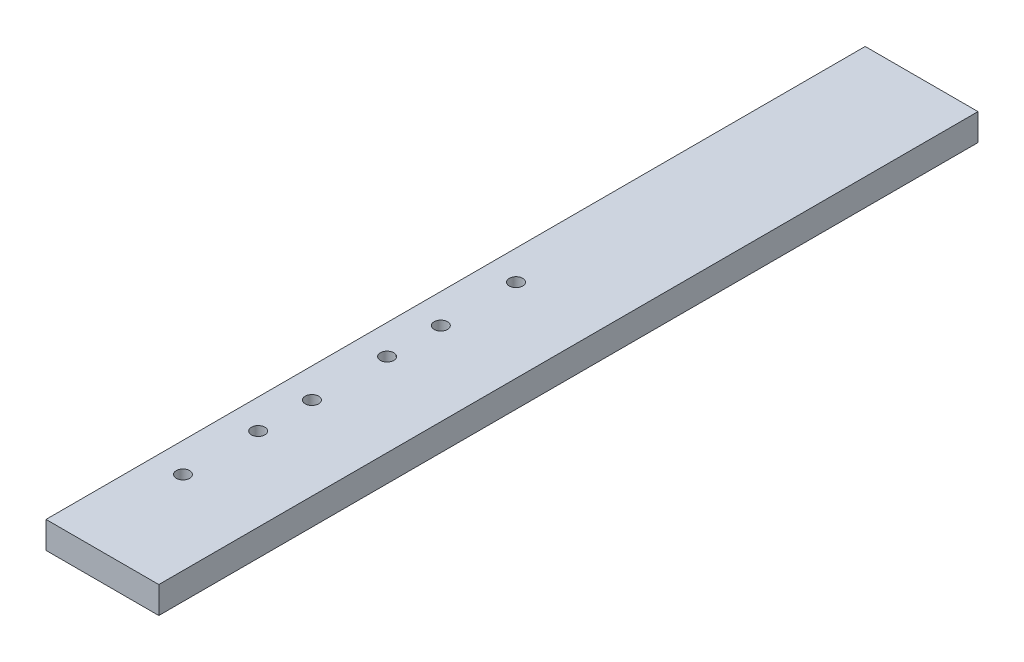
ISO-10303-21;
HEADER;
FILE_DESCRIPTION(('STEP AP214'),'2;1');
FILE_NAME('part.step','',(''),(''),'','','');
FILE_SCHEMA(('AUTOMOTIVE_DESIGN { 1 0 10303 214 1 1 1 1 }'));
ENDSEC;
DATA;
#1=APPLICATION_CONTEXT('core data for automotive mechanical design processes');
#2=APPLICATION_PROTOCOL_DEFINITION('international standard','automotive_design',2000,#1);
#3=PRODUCT_CONTEXT('',#1,'mechanical');
#4=PRODUCT('Part','Part','',(#3));
#5=PRODUCT_RELATED_PRODUCT_CATEGORY('part','',(#4));
#6=PRODUCT_DEFINITION_FORMATION('','',#4);
#7=PRODUCT_DEFINITION_CONTEXT('part definition',#1,'design');
#8=PRODUCT_DEFINITION('design','',#6,#7);
#9=PRODUCT_DEFINITION_SHAPE('','',#8);
#10=(LENGTH_UNIT() NAMED_UNIT(*) SI_UNIT(.MILLI.,.METRE.));
#11=(NAMED_UNIT(*) PLANE_ANGLE_UNIT() SI_UNIT($,.RADIAN.));
#12=(NAMED_UNIT(*) SI_UNIT($,.STERADIAN.) SOLID_ANGLE_UNIT());
#13=UNCERTAINTY_MEASURE_WITH_UNIT(LENGTH_MEASURE(1.E-05),#10,'distance_accuracy_value','');
#14=(GEOMETRIC_REPRESENTATION_CONTEXT(3) GLOBAL_UNCERTAINTY_ASSIGNED_CONTEXT((#13)) GLOBAL_UNIT_ASSIGNED_CONTEXT((#10,
#11,#12)) REPRESENTATION_CONTEXT('',''));
#15=CARTESIAN_POINT('',(0.,0.,0.));
#16=DIRECTION('',(0.,0.,1.));
#17=DIRECTION('',(1.,0.,0.));
#18=AXIS2_PLACEMENT_3D('',#15,#16,#17);
#19=CARTESIAN_POINT('',(0.,6.35,0.));
#20=DIRECTION('',(1.,0.,0.));
#21=DIRECTION('',(0.,0.,-1.));
#22=AXIS2_PLACEMENT_3D('',#19,#20,#21);
#23=PLANE('',#22);
#24=DIRECTION('',(0.,0.,1.));
#25=VECTOR('',#24,1.);
#26=CARTESIAN_POINT('',(0.,0.,0.));
#27=LINE('',#26,#25);
#28=CARTESIAN_POINT('',(0.,0.,-193.675));
#29=VERTEX_POINT('',#28);
#30=CARTESIAN_POINT('',(0.,0.,0.));
#31=VERTEX_POINT('',#30);
#32=EDGE_CURVE('E96',#29,#31,#27,.T.);
#33=ORIENTED_EDGE('',*,*,#32,.T.);
#34=DIRECTION('',(0.,-1.,0.));
#35=VECTOR('',#34,1.);
#36=CARTESIAN_POINT('',(0.,6.35,0.));
#37=LINE('',#36,#35);
#38=CARTESIAN_POINT('',(0.,6.35,0.));
#39=VERTEX_POINT('',#38);
#40=EDGE_CURVE('E11',#39,#31,#37,.T.);
#41=ORIENTED_EDGE('',*,*,#40,.F.);
#42=DIRECTION('',(0.,0.,1.));
#43=VECTOR('',#42,1.);
#44=CARTESIAN_POINT('',(0.,6.35,0.));
#45=LINE('',#44,#43);
#46=CARTESIAN_POINT('',(0.,6.35,-193.675));
#47=VERTEX_POINT('',#46);
#48=EDGE_CURVE('E84',#47,#39,#45,.T.);
#49=ORIENTED_EDGE('',*,*,#48,.F.);
#50=DIRECTION('',(0.,-1.,0.));
#51=VECTOR('',#50,1.);
#52=CARTESIAN_POINT('',(0.,6.35,-193.675));
#53=LINE('',#52,#51);
#54=EDGE_CURVE('E92',#47,#29,#53,.T.);
#55=ORIENTED_EDGE('',*,*,#54,.T.);
#56=EDGE_LOOP('',(#33,#41,#49,#55));
#57=FACE_BOUND('',#56,.T.);
#58=ADVANCED_FACE('F33',(#57),#23,.F.);
#59=CARTESIAN_POINT('',(0.,6.35,0.));
#60=DIRECTION('',(0.,0.,-1.));
#61=DIRECTION('',(-1.,0.,0.));
#62=AXIS2_PLACEMENT_3D('',#59,#60,#61);
#63=PLANE('',#62);
#64=DIRECTION('',(1.,0.,0.));
#65=VECTOR('',#64,1.);
#66=CARTESIAN_POINT('',(0.,0.,0.));
#67=LINE('',#66,#65);
#68=CARTESIAN_POINT('',(26.67,0.,0.));
#69=VERTEX_POINT('',#68);
#70=EDGE_CURVE('E88',#31,#69,#67,.T.);
#71=ORIENTED_EDGE('',*,*,#70,.T.);
#72=DIRECTION('',(0.,-1.,0.));
#73=VECTOR('',#72,1.);
#74=CARTESIAN_POINT('',(26.67,6.35,0.));
#75=LINE('',#74,#73);
#76=CARTESIAN_POINT('',(26.67,6.35,0.));
#77=VERTEX_POINT('',#76);
#78=EDGE_CURVE('E41',#77,#69,#75,.T.);
#79=ORIENTED_EDGE('',*,*,#78,.F.);
#80=DIRECTION('',(1.,0.,0.));
#81=VECTOR('',#80,1.);
#82=CARTESIAN_POINT('',(0.,6.35,0.));
#83=LINE('',#82,#81);
#84=EDGE_CURVE('E79',#39,#77,#83,.T.);
#85=ORIENTED_EDGE('',*,*,#84,.F.);
#86=ORIENTED_EDGE('',*,*,#40,.T.);
#87=EDGE_LOOP('',(#71,#79,#85,#86));
#88=FACE_BOUND('',#87,.T.);
#89=ADVANCED_FACE('F87',(#88),#63,.F.);
#90=CARTESIAN_POINT('',(26.67,6.35,0.));
#91=DIRECTION('',(-1.,0.,0.));
#92=DIRECTION('',(0.,0.,1.));
#93=AXIS2_PLACEMENT_3D('',#90,#91,#92);
#94=PLANE('',#93);
#95=DIRECTION('',(0.,0.,-1.));
#96=VECTOR('',#95,1.);
#97=CARTESIAN_POINT('',(26.67,0.,0.));
#98=LINE('',#97,#96);
#99=CARTESIAN_POINT('',(26.67,0.,-193.675));
#100=VERTEX_POINT('',#99);
#101=EDGE_CURVE('E66',#69,#100,#98,.T.);
#102=ORIENTED_EDGE('',*,*,#101,.T.);
#103=DIRECTION('',(0.,-1.,0.));
#104=VECTOR('',#103,1.);
#105=CARTESIAN_POINT('',(26.67,6.35,-193.675));
#106=LINE('',#105,#104);
#107=CARTESIAN_POINT('',(26.67,6.35,-193.675));
#108=VERTEX_POINT('',#107);
#109=EDGE_CURVE('E89',#108,#100,#106,.T.);
#110=ORIENTED_EDGE('',*,*,#109,.F.);
#111=DIRECTION('',(0.,0.,-1.));
#112=VECTOR('',#111,1.);
#113=CARTESIAN_POINT('',(26.67,6.35,0.));
#114=LINE('',#113,#112);
#115=EDGE_CURVE('E82',#77,#108,#114,.T.);
#116=ORIENTED_EDGE('',*,*,#115,.F.);
#117=ORIENTED_EDGE('',*,*,#78,.T.);
#118=EDGE_LOOP('',(#102,#110,#116,#117));
#119=FACE_BOUND('',#118,.T.);
#120=ADVANCED_FACE('F90',(#119),#94,.F.);
#121=CARTESIAN_POINT('',(0.,6.35,-193.675));
#122=DIRECTION('',(0.,0.,1.));
#123=DIRECTION('',(1.,0.,0.));
#124=AXIS2_PLACEMENT_3D('',#121,#122,#123);
#125=PLANE('',#124);
#126=DIRECTION('',(-1.,0.,0.));
#127=VECTOR('',#126,1.);
#128=CARTESIAN_POINT('',(0.,0.,-193.675));
#129=LINE('',#128,#127);
#130=EDGE_CURVE('E72',#100,#29,#129,.T.);
#131=ORIENTED_EDGE('',*,*,#130,.T.);
#132=ORIENTED_EDGE('',*,*,#54,.F.);
#133=DIRECTION('',(-1.,0.,0.));
#134=VECTOR('',#133,1.);
#135=CARTESIAN_POINT('',(0.,6.35,-193.675));
#136=LINE('',#135,#134);
#137=EDGE_CURVE('E49',#108,#47,#136,.T.);
#138=ORIENTED_EDGE('',*,*,#137,.F.);
#139=ORIENTED_EDGE('',*,*,#109,.T.);
#140=EDGE_LOOP('',(#131,#132,#138,#139));
#141=FACE_BOUND('',#140,.T.);
#142=ADVANCED_FACE('F104',(#141),#125,.F.);
#143=CARTESIAN_POINT('',(0.,6.35,0.));
#144=DIRECTION('',(0.,-1.,0.));
#145=DIRECTION('',(0.,0.,-1.));
#146=AXIS2_PLACEMENT_3D('',#143,#144,#145);
#147=PLANE('',#146);
#148=CARTESIAN_POINT('',(6.985,6.35,-86.36));
#149=DIRECTION('',(0.,1.,0.));
#150=DIRECTION('',(0.,0.,1.));
#151=AXIS2_PLACEMENT_3D('',#148,#149,#150);
#152=CIRCLE('',#151,1.5875);
#153=CARTESIAN_POINT('',(6.985,6.35,-84.7725));
#154=VERTEX_POINT('',#153);
#155=EDGE_CURVE('E140',#154,#154,#152,.T.);
#156=ORIENTED_EDGE('',*,*,#155,.F.);
#157=EDGE_LOOP('',(#156));
#158=FACE_BOUND('',#157,.T.);
#159=CARTESIAN_POINT('',(6.985,6.35,-104.14));
#160=DIRECTION('',(0.,1.,0.));
#161=DIRECTION('',(0.,0.,1.));
#162=AXIS2_PLACEMENT_3D('',#159,#160,#161);
#163=CIRCLE('',#162,1.5875);
#164=CARTESIAN_POINT('',(6.985,6.35,-102.5525));
#165=VERTEX_POINT('',#164);
#166=EDGE_CURVE('E134',#165,#165,#163,.T.);
#167=ORIENTED_EDGE('',*,*,#166,.F.);
#168=EDGE_LOOP('',(#167));
#169=FACE_BOUND('',#168,.T.);
#170=CARTESIAN_POINT('',(6.985,6.35,-55.88));
#171=DIRECTION('',(0.,1.,0.));
#172=DIRECTION('',(0.,0.,-1.));
#173=AXIS2_PLACEMENT_3D('',#170,#171,#172);
#174=CIRCLE('',#173,1.5875);
#175=CARTESIAN_POINT('',(6.985,6.35,-57.4675));
#176=VERTEX_POINT('',#175);
#177=EDGE_CURVE('E128',#176,#176,#174,.T.);
#178=ORIENTED_EDGE('',*,*,#177,.F.);
#179=EDGE_LOOP('',(#178));
#180=FACE_BOUND('',#179,.T.);
#181=CARTESIAN_POINT('',(6.985,6.35,-73.66));
#182=DIRECTION('',(0.,1.,0.));
#183=DIRECTION('',(0.,0.,-1.));
#184=AXIS2_PLACEMENT_3D('',#181,#182,#183);
#185=CIRCLE('',#184,1.5875);
#186=CARTESIAN_POINT('',(6.985,6.35,-75.2475));
#187=VERTEX_POINT('',#186);
#188=EDGE_CURVE('E122',#187,#187,#185,.T.);
#189=ORIENTED_EDGE('',*,*,#188,.F.);
#190=EDGE_LOOP('',(#189));
#191=FACE_BOUND('',#190,.T.);
#192=CARTESIAN_POINT('',(6.985,6.35,-43.18));
#193=DIRECTION('',(0.,1.,0.));
#194=DIRECTION('',(0.,0.,1.));
#195=AXIS2_PLACEMENT_3D('',#192,#193,#194);
#196=CIRCLE('',#195,1.5875);
#197=CARTESIAN_POINT('',(6.985,6.35,-41.5925));
#198=VERTEX_POINT('',#197);
#199=EDGE_CURVE('E116',#198,#198,#196,.T.);
#200=ORIENTED_EDGE('',*,*,#199,.F.);
#201=EDGE_LOOP('',(#200));
#202=FACE_BOUND('',#201,.T.);
#203=CARTESIAN_POINT('',(6.985,6.35,-25.4));
#204=DIRECTION('',(0.,1.,0.));
#205=DIRECTION('',(0.,0.,1.));
#206=AXIS2_PLACEMENT_3D('',#203,#204,#205);
#207=CIRCLE('',#206,1.5875);
#208=CARTESIAN_POINT('',(6.985,6.35,-23.8125));
#209=VERTEX_POINT('',#208);
#210=EDGE_CURVE('E110',#209,#209,#207,.T.);
#211=ORIENTED_EDGE('',*,*,#210,.F.);
#212=EDGE_LOOP('',(#211));
#213=FACE_BOUND('',#212,.T.);
#214=ORIENTED_EDGE('',*,*,#48,.T.);
#215=ORIENTED_EDGE('',*,*,#84,.T.);
#216=ORIENTED_EDGE('',*,*,#115,.T.);
#217=ORIENTED_EDGE('',*,*,#137,.T.);
#218=EDGE_LOOP('',(#214,#215,#216,#217));
#219=FACE_BOUND('',#218,.T.);
#220=ADVANCED_FACE('F80',(#158,#169,#180,#191,#202,#213,#219),#147,.F.);
#221=CARTESIAN_POINT('',(0.,0.,0.));
#222=DIRECTION('',(0.,-1.,0.));
#223=DIRECTION('',(0.,0.,-1.));
#224=AXIS2_PLACEMENT_3D('',#221,#222,#223);
#225=PLANE('',#224);
#226=CARTESIAN_POINT('',(6.985,0.,-86.36));
#227=DIRECTION('',(0.,1.,0.));
#228=DIRECTION('',(0.,0.,1.));
#229=AXIS2_PLACEMENT_3D('',#226,#227,#228);
#230=CIRCLE('',#229,1.5875);
#231=CARTESIAN_POINT('',(6.985,0.,-84.7725));
#232=VERTEX_POINT('',#231);
#233=EDGE_CURVE('E137',#232,#232,#230,.T.);
#234=ORIENTED_EDGE('',*,*,#233,.T.);
#235=EDGE_LOOP('',(#234));
#236=FACE_BOUND('',#235,.T.);
#237=CARTESIAN_POINT('',(6.985,0.,-104.14));
#238=DIRECTION('',(0.,1.,0.));
#239=DIRECTION('',(0.,0.,1.));
#240=AXIS2_PLACEMENT_3D('',#237,#238,#239);
#241=CIRCLE('',#240,1.5875);
#242=CARTESIAN_POINT('',(6.985,0.,-102.5525));
#243=VERTEX_POINT('',#242);
#244=EDGE_CURVE('E131',#243,#243,#241,.T.);
#245=ORIENTED_EDGE('',*,*,#244,.T.);
#246=EDGE_LOOP('',(#245));
#247=FACE_BOUND('',#246,.T.);
#248=CARTESIAN_POINT('',(6.985,0.,-55.88));
#249=DIRECTION('',(0.,1.,0.));
#250=DIRECTION('',(0.,0.,-1.));
#251=AXIS2_PLACEMENT_3D('',#248,#249,#250);
#252=CIRCLE('',#251,1.5875);
#253=CARTESIAN_POINT('',(6.985,0.,-57.4675));
#254=VERTEX_POINT('',#253);
#255=EDGE_CURVE('E125',#254,#254,#252,.T.);
#256=ORIENTED_EDGE('',*,*,#255,.T.);
#257=EDGE_LOOP('',(#256));
#258=FACE_BOUND('',#257,.T.);
#259=CARTESIAN_POINT('',(6.985,0.,-73.66));
#260=DIRECTION('',(0.,1.,0.));
#261=DIRECTION('',(0.,0.,-1.));
#262=AXIS2_PLACEMENT_3D('',#259,#260,#261);
#263=CIRCLE('',#262,1.5875);
#264=CARTESIAN_POINT('',(6.985,0.,-75.2475));
#265=VERTEX_POINT('',#264);
#266=EDGE_CURVE('E119',#265,#265,#263,.T.);
#267=ORIENTED_EDGE('',*,*,#266,.T.);
#268=EDGE_LOOP('',(#267));
#269=FACE_BOUND('',#268,.T.);
#270=CARTESIAN_POINT('',(6.985,0.,-43.18));
#271=DIRECTION('',(0.,1.,0.));
#272=DIRECTION('',(0.,0.,1.));
#273=AXIS2_PLACEMENT_3D('',#270,#271,#272);
#274=CIRCLE('',#273,1.5875);
#275=CARTESIAN_POINT('',(6.985,0.,-41.5925));
#276=VERTEX_POINT('',#275);
#277=EDGE_CURVE('E113',#276,#276,#274,.T.);
#278=ORIENTED_EDGE('',*,*,#277,.T.);
#279=EDGE_LOOP('',(#278));
#280=FACE_BOUND('',#279,.T.);
#281=CARTESIAN_POINT('',(6.985,0.,-25.4));
#282=DIRECTION('',(0.,1.,0.));
#283=DIRECTION('',(0.,0.,1.));
#284=AXIS2_PLACEMENT_3D('',#281,#282,#283);
#285=CIRCLE('',#284,1.5875);
#286=CARTESIAN_POINT('',(6.985,0.,-23.8125));
#287=VERTEX_POINT('',#286);
#288=EDGE_CURVE('E99',#287,#287,#285,.T.);
#289=ORIENTED_EDGE('',*,*,#288,.T.);
#290=EDGE_LOOP('',(#289));
#291=FACE_BOUND('',#290,.T.);
#292=ORIENTED_EDGE('',*,*,#32,.F.);
#293=ORIENTED_EDGE('',*,*,#130,.F.);
#294=ORIENTED_EDGE('',*,*,#101,.F.);
#295=ORIENTED_EDGE('',*,*,#70,.F.);
#296=EDGE_LOOP('',(#292,#293,#294,#295));
#297=FACE_BOUND('',#296,.T.);
#298=ADVANCED_FACE('F107',(#236,#247,#258,#269,#280,#291,#297),#225,.T.);
#299=CARTESIAN_POINT('',(6.985,0.,-25.4));
#300=DIRECTION('',(0.,1.,0.));
#301=DIRECTION('',(0.,0.,1.));
#302=AXIS2_PLACEMENT_3D('',#299,#300,#301);
#303=CYLINDRICAL_SURFACE('',#302,1.5875);
#304=ORIENTED_EDGE('',*,*,#288,.F.);
#305=EDGE_LOOP('',(#304));
#306=FACE_BOUND('',#305,.T.);
#307=ORIENTED_EDGE('',*,*,#210,.T.);
#308=EDGE_LOOP('',(#307));
#309=FACE_BOUND('',#308,.T.);
#310=ADVANCED_FACE('F168',(#306,#309),#303,.F.);
#311=CARTESIAN_POINT('',(6.985,0.,-43.18));
#312=DIRECTION('',(0.,1.,0.));
#313=DIRECTION('',(0.,0.,1.));
#314=AXIS2_PLACEMENT_3D('',#311,#312,#313);
#315=CYLINDRICAL_SURFACE('',#314,1.5875);
#316=ORIENTED_EDGE('',*,*,#277,.F.);
#317=EDGE_LOOP('',(#316));
#318=FACE_BOUND('',#317,.T.);
#319=ORIENTED_EDGE('',*,*,#199,.T.);
#320=EDGE_LOOP('',(#319));
#321=FACE_BOUND('',#320,.T.);
#322=ADVANCED_FACE('F170',(#318,#321),#315,.F.);
#323=CARTESIAN_POINT('',(6.985,0.,-73.66));
#324=DIRECTION('',(0.,1.,0.));
#325=DIRECTION('',(0.,0.,1.));
#326=AXIS2_PLACEMENT_3D('',#323,#324,#325);
#327=CYLINDRICAL_SURFACE('',#326,1.5875);
#328=ORIENTED_EDGE('',*,*,#266,.F.);
#329=EDGE_LOOP('',(#328));
#330=FACE_BOUND('',#329,.T.);
#331=ORIENTED_EDGE('',*,*,#188,.T.);
#332=EDGE_LOOP('',(#331));
#333=FACE_BOUND('',#332,.T.);
#334=ADVANCED_FACE('F177',(#330,#333),#327,.F.);
#335=CARTESIAN_POINT('',(6.985,0.,-55.88));
#336=DIRECTION('',(0.,1.,0.));
#337=DIRECTION('',(0.,0.,1.));
#338=AXIS2_PLACEMENT_3D('',#335,#336,#337);
#339=CYLINDRICAL_SURFACE('',#338,1.5875);
#340=ORIENTED_EDGE('',*,*,#255,.F.);
#341=EDGE_LOOP('',(#340));
#342=FACE_BOUND('',#341,.T.);
#343=ORIENTED_EDGE('',*,*,#177,.T.);
#344=EDGE_LOOP('',(#343));
#345=FACE_BOUND('',#344,.T.);
#346=ADVANCED_FACE('F223',(#342,#345),#339,.F.);
#347=CARTESIAN_POINT('',(6.985,0.,-104.14));
#348=DIRECTION('',(0.,1.,0.));
#349=DIRECTION('',(0.,0.,1.));
#350=AXIS2_PLACEMENT_3D('',#347,#348,#349);
#351=CYLINDRICAL_SURFACE('',#350,1.5875);
#352=ORIENTED_EDGE('',*,*,#244,.F.);
#353=EDGE_LOOP('',(#352));
#354=FACE_BOUND('',#353,.T.);
#355=ORIENTED_EDGE('',*,*,#166,.T.);
#356=EDGE_LOOP('',(#355));
#357=FACE_BOUND('',#356,.T.);
#358=ADVANCED_FACE('F151',(#354,#357),#351,.F.);
#359=CARTESIAN_POINT('',(6.985,0.,-86.36));
#360=DIRECTION('',(0.,1.,0.));
#361=DIRECTION('',(0.,0.,1.));
#362=AXIS2_PLACEMENT_3D('',#359,#360,#361);
#363=CYLINDRICAL_SURFACE('',#362,1.5875);
#364=ORIENTED_EDGE('',*,*,#233,.F.);
#365=EDGE_LOOP('',(#364));
#366=FACE_BOUND('',#365,.T.);
#367=ORIENTED_EDGE('',*,*,#155,.T.);
#368=EDGE_LOOP('',(#367));
#369=FACE_BOUND('',#368,.T.);
#370=ADVANCED_FACE('F148',(#366,#369),#363,.F.);
#371=CLOSED_SHELL('',(#58,#89,#120,#142,#220,#298,#310,#322,#334,#346,#358,#370));
#372=MANIFOLD_SOLID_BREP('B2',#371);
#373=ADVANCED_BREP_SHAPE_REPRESENTATION('',(#18,#372),#14);
#374=SHAPE_DEFINITION_REPRESENTATION(#9,#373);
ENDSEC;
END-ISO-10303-21;
